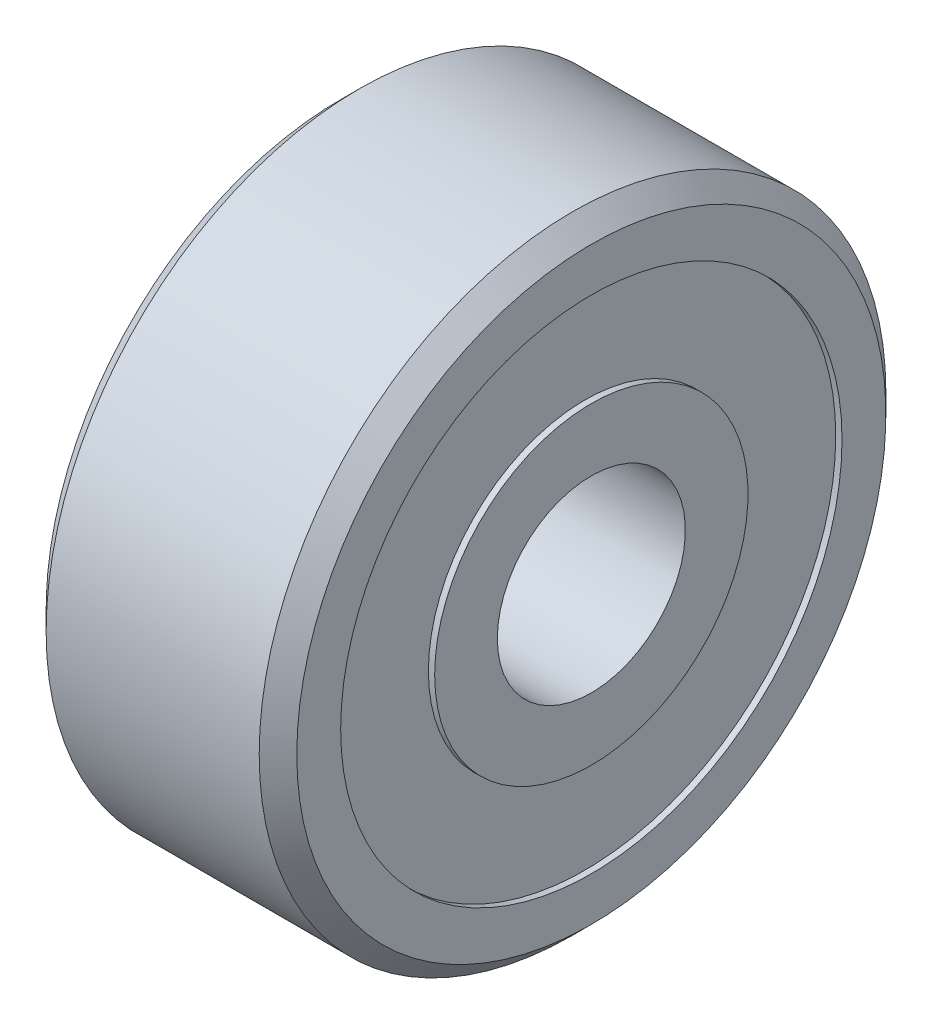
ISO-10303-21;
HEADER;
FILE_DESCRIPTION(('STEP AP214'),'2;1');
FILE_NAME('part.step','',(''),(''),'','','');
FILE_SCHEMA(('AUTOMOTIVE_DESIGN { 1 0 10303 214 1 1 1 1 }'));
ENDSEC;
DATA;
#1=APPLICATION_CONTEXT('core data for automotive mechanical design processes');
#2=APPLICATION_PROTOCOL_DEFINITION('international standard','automotive_design',2000,#1);
#3=PRODUCT_CONTEXT('',#1,'mechanical');
#4=PRODUCT('Part','Part','',(#3));
#5=PRODUCT_RELATED_PRODUCT_CATEGORY('part','',(#4));
#6=PRODUCT_DEFINITION_FORMATION('','',#4);
#7=PRODUCT_DEFINITION_CONTEXT('part definition',#1,'design');
#8=PRODUCT_DEFINITION('design','',#6,#7);
#9=PRODUCT_DEFINITION_SHAPE('','',#8);
#10=(LENGTH_UNIT() NAMED_UNIT(*) SI_UNIT(.MILLI.,.METRE.));
#11=(NAMED_UNIT(*) PLANE_ANGLE_UNIT() SI_UNIT($,.RADIAN.));
#12=(NAMED_UNIT(*) SI_UNIT($,.STERADIAN.) SOLID_ANGLE_UNIT());
#13=UNCERTAINTY_MEASURE_WITH_UNIT(LENGTH_MEASURE(1.E-05),#10,'distance_accuracy_value','');
#14=(GEOMETRIC_REPRESENTATION_CONTEXT(3) GLOBAL_UNCERTAINTY_ASSIGNED_CONTEXT((#13)) GLOBAL_UNIT_ASSIGNED_CONTEXT((#10,
#11,#12)) REPRESENTATION_CONTEXT('',''));
#15=CARTESIAN_POINT('',(0.,0.,0.));
#16=DIRECTION('',(0.,0.,1.));
#17=DIRECTION('',(1.,0.,0.));
#18=AXIS2_PLACEMENT_3D('',#15,#16,#17);
#19=CARTESIAN_POINT('',(-1.9666088223,-22.5652643177,178.13));
#20=DIRECTION('',(-1.,0.,0.));
#21=DIRECTION('',(0.,0.,1.));
#22=AXIS2_PLACEMENT_3D('',#19,#20,#21);
#23=CYLINDRICAL_SURFACE('',#22,1.5);
#24=CARTESIAN_POINT('',(2.0333911777,-22.5652643177,178.13));
#25=DIRECTION('',(-1.,0.,0.));
#26=DIRECTION('',(0.,0.,1.));
#27=AXIS2_PLACEMENT_3D('',#24,#25,#26);
#28=CIRCLE('',#27,1.5);
#29=CARTESIAN_POINT('',(2.0333911777,-22.5652643177,179.63));
#30=VERTEX_POINT('',#29);
#31=EDGE_CURVE('E57',#30,#30,#28,.F.);
#32=ORIENTED_EDGE('',*,*,#31,.T.);
#33=EDGE_LOOP('',(#32));
#34=FACE_BOUND('',#33,.T.);
#35=CARTESIAN_POINT('',(-1.9666088223,-22.5652643177,178.13));
#36=DIRECTION('',(-1.,0.,0.));
#37=DIRECTION('',(0.,0.,1.));
#38=AXIS2_PLACEMENT_3D('',#35,#36,#37);
#39=CIRCLE('',#38,1.5);
#40=CARTESIAN_POINT('',(-1.9666088223,-22.5652643177,179.63));
#41=VERTEX_POINT('',#40);
#42=EDGE_CURVE('E17',#41,#41,#39,.F.);
#43=ORIENTED_EDGE('',*,*,#42,.F.);
#44=EDGE_LOOP('',(#43));
#45=FACE_BOUND('',#44,.T.);
#46=ADVANCED_FACE('F14',(#34,#45),#23,.F.);
#47=CARTESIAN_POINT('',(-1.9666088223,-20.0652643177,178.13));
#48=DIRECTION('',(-1.,0.,0.));
#49=DIRECTION('',(0.,0.,1.));
#50=AXIS2_PLACEMENT_3D('',#47,#48,#49);
#51=PLANE('',#50);
#52=ORIENTED_EDGE('',*,*,#42,.T.);
#53=EDGE_LOOP('',(#52));
#54=FACE_BOUND('',#53,.T.);
#55=CARTESIAN_POINT('',(-1.9666088223,-22.5652643177,178.13));
#56=DIRECTION('',(-1.,0.,0.));
#57=DIRECTION('',(0.,0.,1.));
#58=AXIS2_PLACEMENT_3D('',#55,#56,#57);
#59=CIRCLE('',#58,2.5);
#60=CARTESIAN_POINT('',(-1.9666088223,-22.5652643177,180.63));
#61=VERTEX_POINT('',#60);
#62=EDGE_CURVE('E55',#61,#61,#59,.F.);
#63=ORIENTED_EDGE('',*,*,#62,.F.);
#64=EDGE_LOOP('',(#63));
#65=FACE_BOUND('',#64,.T.);
#66=ADVANCED_FACE('F64',(#54,#65),#51,.T.);
#67=CARTESIAN_POINT('',(2.0333911777,-20.0652643177,178.13));
#68=DIRECTION('',(-1.,0.,0.));
#69=DIRECTION('',(0.,0.,1.));
#70=AXIS2_PLACEMENT_3D('',#67,#68,#69);
#71=PLANE('',#70);
#72=ORIENTED_EDGE('',*,*,#31,.F.);
#73=EDGE_LOOP('',(#72));
#74=FACE_BOUND('',#73,.T.);
#75=CARTESIAN_POINT('',(2.0333911777,-22.5652643177,178.13));
#76=DIRECTION('',(-1.,0.,0.));
#77=DIRECTION('',(0.,0.,1.));
#78=AXIS2_PLACEMENT_3D('',#75,#76,#77);
#79=CIRCLE('',#78,2.5);
#80=CARTESIAN_POINT('',(2.0333911777,-22.5652643177,180.63));
#81=VERTEX_POINT('',#80);
#82=EDGE_CURVE('E52',#81,#81,#79,.T.);
#83=ORIENTED_EDGE('',*,*,#82,.F.);
#84=EDGE_LOOP('',(#83));
#85=FACE_BOUND('',#84,.T.);
#86=ADVANCED_FACE('F72',(#74,#85),#71,.F.);
#87=CARTESIAN_POINT('',(-1.9666088223,-22.5652643177,178.13));
#88=DIRECTION('',(-1.,0.,0.));
#89=DIRECTION('',(0.,0.,1.));
#90=AXIS2_PLACEMENT_3D('',#87,#88,#89);
#91=CYLINDRICAL_SURFACE('',#90,2.5);
#92=CARTESIAN_POINT('',(-1.8666088223,-22.5652643177,178.13));
#93=DIRECTION('',(-1.,0.,0.));
#94=DIRECTION('',(0.,0.,1.));
#95=AXIS2_PLACEMENT_3D('',#92,#93,#94);
#96=CIRCLE('',#95,2.5);
#97=CARTESIAN_POINT('',(-1.8666088223,-22.5652643177,180.63));
#98=VERTEX_POINT('',#97);
#99=EDGE_CURVE('E49',#98,#98,#96,.F.);
#100=ORIENTED_EDGE('',*,*,#99,.F.);
#101=EDGE_LOOP('',(#100));
#102=FACE_BOUND('',#101,.T.);
#103=ORIENTED_EDGE('',*,*,#62,.T.);
#104=EDGE_LOOP('',(#103));
#105=FACE_BOUND('',#104,.T.);
#106=ADVANCED_FACE('F115',(#102,#105),#91,.T.);
#107=CARTESIAN_POINT('',(-1.9666088223,-22.5652643177,178.13));
#108=DIRECTION('',(-1.,0.,0.));
#109=DIRECTION('',(0.,0.,1.));
#110=AXIS2_PLACEMENT_3D('',#107,#108,#109);
#111=CYLINDRICAL_SURFACE('',#110,2.5);
#112=ORIENTED_EDGE('',*,*,#82,.T.);
#113=EDGE_LOOP('',(#112));
#114=FACE_BOUND('',#113,.T.);
#115=CARTESIAN_POINT('',(1.933391130016,-22.5652643177,178.13));
#116=DIRECTION('',(-1.,0.,0.));
#117=DIRECTION('',(0.,0.,1.));
#118=AXIS2_PLACEMENT_3D('',#115,#116,#117);
#119=CIRCLE('',#118,2.5);
#120=CARTESIAN_POINT('',(1.933391130016,-22.5652643177,180.63));
#121=VERTEX_POINT('',#120);
#122=EDGE_CURVE('E46',#121,#121,#119,.F.);
#123=ORIENTED_EDGE('',*,*,#122,.T.);
#124=EDGE_LOOP('',(#123));
#125=FACE_BOUND('',#124,.T.);
#126=ADVANCED_FACE('F111',(#114,#125),#111,.T.);
#127=CARTESIAN_POINT('',(-1.8666088223,-18.5652643177,178.13));
#128=DIRECTION('',(-1.,0.,0.));
#129=DIRECTION('',(0.,0.,1.));
#130=AXIS2_PLACEMENT_3D('',#127,#128,#129);
#131=PLANE('',#130);
#132=ORIENTED_EDGE('',*,*,#99,.T.);
#133=EDGE_LOOP('',(#132));
#134=FACE_BOUND('',#133,.T.);
#135=CARTESIAN_POINT('',(-1.8666088223,-22.5652643177,178.13));
#136=DIRECTION('',(-1.,0.,0.));
#137=DIRECTION('',(0.,0.,1.));
#138=AXIS2_PLACEMENT_3D('',#135,#136,#137);
#139=CIRCLE('',#138,4.);
#140=CARTESIAN_POINT('',(-1.8666088223,-22.5652643177,182.13));
#141=VERTEX_POINT('',#140);
#142=EDGE_CURVE('E43',#141,#141,#139,.T.);
#143=ORIENTED_EDGE('',*,*,#142,.T.);
#144=EDGE_LOOP('',(#143));
#145=FACE_BOUND('',#144,.T.);
#146=ADVANCED_FACE('F107',(#134,#145),#131,.T.);
#147=CARTESIAN_POINT('',(1.933391130016,-18.5652643177,178.13));
#148=DIRECTION('',(-1.,0.,0.));
#149=DIRECTION('',(0.,0.,1.));
#150=AXIS2_PLACEMENT_3D('',#147,#148,#149);
#151=PLANE('',#150);
#152=ORIENTED_EDGE('',*,*,#122,.F.);
#153=EDGE_LOOP('',(#152));
#154=FACE_BOUND('',#153,.T.);
#155=CARTESIAN_POINT('',(1.933391130016,-22.5652643177,178.13));
#156=DIRECTION('',(-1.,0.,0.));
#157=DIRECTION('',(0.,0.,1.));
#158=AXIS2_PLACEMENT_3D('',#155,#156,#157);
#159=CIRCLE('',#158,4.);
#160=CARTESIAN_POINT('',(1.933391130016,-22.5652643177,182.13));
#161=VERTEX_POINT('',#160);
#162=EDGE_CURVE('E40',#161,#161,#159,.F.);
#163=ORIENTED_EDGE('',*,*,#162,.T.);
#164=EDGE_LOOP('',(#163));
#165=FACE_BOUND('',#164,.T.);
#166=ADVANCED_FACE('F103',(#154,#165),#151,.F.);
#167=CARTESIAN_POINT('',(-1.9666088223,-22.5652643177,178.13));
#168=DIRECTION('',(-1.,0.,0.));
#169=DIRECTION('',(0.,0.,1.));
#170=AXIS2_PLACEMENT_3D('',#167,#168,#169);
#171=CYLINDRICAL_SURFACE('',#170,4.);
#172=ORIENTED_EDGE('',*,*,#142,.F.);
#173=EDGE_LOOP('',(#172));
#174=FACE_BOUND('',#173,.T.);
#175=CARTESIAN_POINT('',(-1.9666088223,-22.5652643177,178.13));
#176=DIRECTION('',(-1.,0.,0.));
#177=DIRECTION('',(0.,0.,1.));
#178=AXIS2_PLACEMENT_3D('',#175,#176,#177);
#179=CIRCLE('',#178,4.);
#180=CARTESIAN_POINT('',(-1.9666088223,-22.5652643177,182.13));
#181=VERTEX_POINT('',#180);
#182=EDGE_CURVE('E37',#181,#181,#179,.F.);
#183=ORIENTED_EDGE('',*,*,#182,.F.);
#184=EDGE_LOOP('',(#183));
#185=FACE_BOUND('',#184,.T.);
#186=ADVANCED_FACE('F99',(#174,#185),#171,.F.);
#187=CARTESIAN_POINT('',(-1.9666088223,-22.5652643177,178.13));
#188=DIRECTION('',(-1.,0.,0.));
#189=DIRECTION('',(0.,0.,1.));
#190=AXIS2_PLACEMENT_3D('',#187,#188,#189);
#191=CYLINDRICAL_SURFACE('',#190,4.);
#192=CARTESIAN_POINT('',(2.0333911777,-22.5652643177,178.13));
#193=DIRECTION('',(-1.,0.,0.));
#194=DIRECTION('',(0.,0.,1.));
#195=AXIS2_PLACEMENT_3D('',#192,#193,#194);
#196=CIRCLE('',#195,4.);
#197=CARTESIAN_POINT('',(2.0333911777,-22.5652643177,182.13));
#198=VERTEX_POINT('',#197);
#199=EDGE_CURVE('E34',#198,#198,#196,.F.);
#200=ORIENTED_EDGE('',*,*,#199,.T.);
#201=EDGE_LOOP('',(#200));
#202=FACE_BOUND('',#201,.T.);
#203=ORIENTED_EDGE('',*,*,#162,.F.);
#204=EDGE_LOOP('',(#203));
#205=FACE_BOUND('',#204,.T.);
#206=ADVANCED_FACE('F95',(#202,#205),#191,.F.);
#207=CARTESIAN_POINT('',(-1.9666088223,-17.5652643177,178.13));
#208=DIRECTION('',(-1.,0.,0.));
#209=DIRECTION('',(0.,0.,1.));
#210=AXIS2_PLACEMENT_3D('',#207,#208,#209);
#211=PLANE('',#210);
#212=ORIENTED_EDGE('',*,*,#182,.T.);
#213=EDGE_LOOP('',(#212));
#214=FACE_BOUND('',#213,.T.);
#215=CARTESIAN_POINT('',(-1.96660882238575,-22.5652643177,178.13));
#216=DIRECTION('',(1.,0.,0.));
#217=DIRECTION('',(0.,0.,-1.));
#218=AXIS2_PLACEMENT_3D('',#215,#216,#217);
#219=CIRCLE('',#218,4.69999998804271);
#220=CARTESIAN_POINT('',(-1.96660882238575,-22.5652643177,173.430000011957));
#221=VERTEX_POINT('',#220);
#222=EDGE_CURVE('E31',#221,#221,#219,.T.);
#223=ORIENTED_EDGE('',*,*,#222,.F.);
#224=EDGE_LOOP('',(#223));
#225=FACE_BOUND('',#224,.T.);
#226=ADVANCED_FACE('F91',(#214,#225),#211,.T.);
#227=CARTESIAN_POINT('',(2.0333911777,-17.5652643177,178.13));
#228=DIRECTION('',(-1.,0.,0.));
#229=DIRECTION('',(0.,0.,1.));
#230=AXIS2_PLACEMENT_3D('',#227,#228,#229);
#231=PLANE('',#230);
#232=ORIENTED_EDGE('',*,*,#199,.F.);
#233=EDGE_LOOP('',(#232));
#234=FACE_BOUND('',#233,.T.);
#235=CARTESIAN_POINT('',(2.03339117769019,-22.5652643177,178.13));
#236=DIRECTION('',(-1.,0.,0.));
#237=DIRECTION('',(0.,0.,1.));
#238=AXIS2_PLACEMENT_3D('',#235,#236,#237);
#239=CIRCLE('',#238,4.69999998809955);
#240=CARTESIAN_POINT('',(2.03339117769019,-22.5652643177,182.8299999881));
#241=VERTEX_POINT('',#240);
#242=EDGE_CURVE('E26',#241,#241,#239,.T.);
#243=ORIENTED_EDGE('',*,*,#242,.F.);
#244=EDGE_LOOP('',(#243));
#245=FACE_BOUND('',#244,.T.);
#246=ADVANCED_FACE('F87',(#234,#245),#231,.F.);
#247=CARTESIAN_POINT('',(-1.66660881041025,-22.5652643177,178.13));
#248=DIRECTION('',(1.,0.,0.));
#249=DIRECTION('',(0.,0.,-1.));
#250=AXIS2_PLACEMENT_3D('',#247,#248,#249);
#251=CONICAL_SURFACE('',#250,4.99999999996136,0.785398163302709);
#252=CARTESIAN_POINT('',(-1.666608810379,-22.5652643177,178.13));
#253=DIRECTION('',(-1.,0.,0.));
#254=DIRECTION('',(0.,0.,1.));
#255=AXIS2_PLACEMENT_3D('',#252,#253,#254);
#256=CIRCLE('',#255,5.);
#257=CARTESIAN_POINT('',(-1.666608810379,-22.5652643177,183.13));
#258=VERTEX_POINT('',#257);
#259=EDGE_CURVE('E21',#258,#258,#256,.F.);
#260=ORIENTED_EDGE('',*,*,#259,.F.);
#261=EDGE_LOOP('',(#260));
#262=FACE_BOUND('',#261,.T.);
#263=ORIENTED_EDGE('',*,*,#222,.T.);
#264=EDGE_LOOP('',(#263));
#265=FACE_BOUND('',#264,.T.);
#266=ADVANCED_FACE('F80',(#262,#265),#251,.T.);
#267=CARTESIAN_POINT('',(1.73339116571469,-22.5652643177,178.13));
#268=DIRECTION('',(-1.,0.,0.));
#269=DIRECTION('',(0.,0.,1.));
#270=AXIS2_PLACEMENT_3D('',#267,#268,#269);
#271=CONICAL_SURFACE('',#270,5.00000000007505,0.785398163397448);
#272=CARTESIAN_POINT('',(1.733391165779,-22.5652643177,178.13));
#273=DIRECTION('',(-1.,0.,0.));
#274=DIRECTION('',(0.,0.,1.));
#275=AXIS2_PLACEMENT_3D('',#272,#273,#274);
#276=CIRCLE('',#275,5.);
#277=CARTESIAN_POINT('',(1.733391165779,-22.5652643177,183.13));
#278=VERTEX_POINT('',#277);
#279=EDGE_CURVE('E10',#278,#278,#276,.T.);
#280=ORIENTED_EDGE('',*,*,#279,.F.);
#281=EDGE_LOOP('',(#280));
#282=FACE_BOUND('',#281,.T.);
#283=ORIENTED_EDGE('',*,*,#242,.T.);
#284=EDGE_LOOP('',(#283));
#285=FACE_BOUND('',#284,.T.);
#286=ADVANCED_FACE('F75',(#282,#285),#271,.T.);
#287=CARTESIAN_POINT('',(-1.9666088223,-22.5652643177,178.13));
#288=DIRECTION('',(-1.,0.,0.));
#289=DIRECTION('',(0.,0.,1.));
#290=AXIS2_PLACEMENT_3D('',#287,#288,#289);
#291=CYLINDRICAL_SURFACE('',#290,5.);
#292=ORIENTED_EDGE('',*,*,#279,.T.);
#293=EDGE_LOOP('',(#292));
#294=FACE_BOUND('',#293,.T.);
#295=ORIENTED_EDGE('',*,*,#259,.T.);
#296=EDGE_LOOP('',(#295));
#297=FACE_BOUND('',#296,.T.);
#298=ADVANCED_FACE('F73',(#294,#297),#291,.T.);
#299=CLOSED_SHELL('',(#46,#66,#86,#106,#126,#146,#166,#186,#206,#226,#246,#266,#286,#298));
#300=MANIFOLD_SOLID_BREP('B1',#299);
#301=ADVANCED_BREP_SHAPE_REPRESENTATION('',(#18,#300),#14);
#302=SHAPE_DEFINITION_REPRESENTATION(#9,#301);
ENDSEC;
END-ISO-10303-21;
